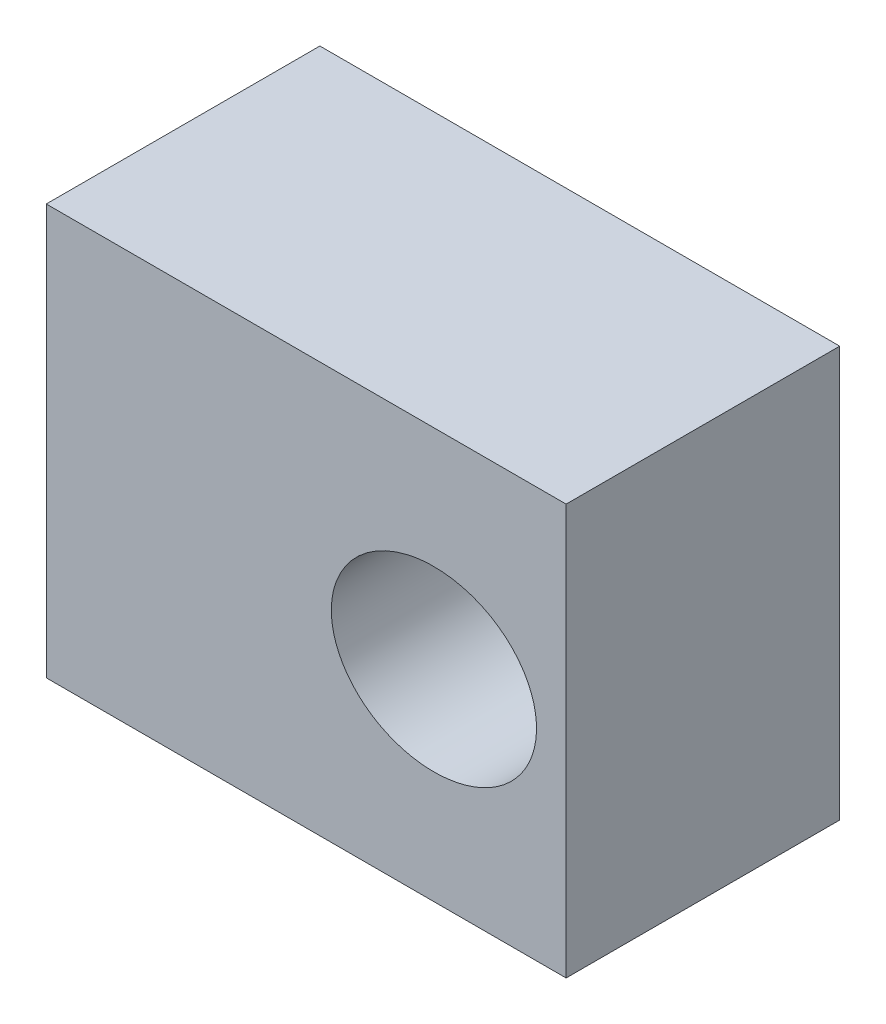
ISO-10303-21;
HEADER;
FILE_DESCRIPTION(('STEP AP214'),'2;1');
FILE_NAME('part.step','',(''),(''),'','','');
FILE_SCHEMA(('AUTOMOTIVE_DESIGN { 1 0 10303 214 1 1 1 1 }'));
ENDSEC;
DATA;
#1=APPLICATION_CONTEXT('core data for automotive mechanical design processes');
#2=APPLICATION_PROTOCOL_DEFINITION('international standard','automotive_design',2000,#1);
#3=PRODUCT_CONTEXT('',#1,'mechanical');
#4=PRODUCT('Part','Part','',(#3));
#5=PRODUCT_RELATED_PRODUCT_CATEGORY('part','',(#4));
#6=PRODUCT_DEFINITION_FORMATION('','',#4);
#7=PRODUCT_DEFINITION_CONTEXT('part definition',#1,'design');
#8=PRODUCT_DEFINITION('design','',#6,#7);
#9=PRODUCT_DEFINITION_SHAPE('','',#8);
#10=(LENGTH_UNIT() NAMED_UNIT(*) SI_UNIT(.MILLI.,.METRE.));
#11=(NAMED_UNIT(*) PLANE_ANGLE_UNIT() SI_UNIT($,.RADIAN.));
#12=(NAMED_UNIT(*) SI_UNIT($,.STERADIAN.) SOLID_ANGLE_UNIT());
#13=UNCERTAINTY_MEASURE_WITH_UNIT(LENGTH_MEASURE(1.E-05),#10,'distance_accuracy_value','');
#14=(GEOMETRIC_REPRESENTATION_CONTEXT(3) GLOBAL_UNCERTAINTY_ASSIGNED_CONTEXT((#13)) GLOBAL_UNIT_ASSIGNED_CONTEXT((#10,
#11,#12)) REPRESENTATION_CONTEXT('',''));
#15=CARTESIAN_POINT('',(0.,0.,0.));
#16=DIRECTION('',(0.,0.,1.));
#17=DIRECTION('',(1.,0.,0.));
#18=AXIS2_PLACEMENT_3D('',#15,#16,#17);
#19=CARTESIAN_POINT('',(95.,75.,0.));
#20=DIRECTION('',(0.,0.,1.));
#21=DIRECTION('',(1.,0.,0.));
#22=AXIS2_PLACEMENT_3D('',#19,#20,#21);
#23=PLANE('',#22);
#24=DIRECTION('',(0.,-1.,0.));
#25=VECTOR('',#24,1.);
#26=CARTESIAN_POINT('',(0.,150.,0.));
#27=LINE('',#26,#25);
#28=CARTESIAN_POINT('',(0.,150.,0.));
#29=VERTEX_POINT('',#28);
#30=CARTESIAN_POINT('',(0.,0.,0.));
#31=VERTEX_POINT('',#30);
#32=EDGE_CURVE('E23',#29,#31,#27,.T.);
#33=ORIENTED_EDGE('',*,*,#32,.F.);
#34=DIRECTION('',(-1.,0.,0.));
#35=VECTOR('',#34,1.);
#36=CARTESIAN_POINT('',(190.,150.,0.));
#37=LINE('',#36,#35);
#38=CARTESIAN_POINT('',(190.,150.,0.));
#39=VERTEX_POINT('',#38);
#40=EDGE_CURVE('E95',#39,#29,#37,.T.);
#41=ORIENTED_EDGE('',*,*,#40,.F.);
#42=DIRECTION('',(0.,1.,0.));
#43=VECTOR('',#42,1.);
#44=CARTESIAN_POINT('',(190.,0.,0.));
#45=LINE('',#44,#43);
#46=CARTESIAN_POINT('',(190.,0.,0.));
#47=VERTEX_POINT('',#46);
#48=EDGE_CURVE('E100',#47,#39,#45,.T.);
#49=ORIENTED_EDGE('',*,*,#48,.F.);
#50=DIRECTION('',(1.,0.,0.));
#51=VECTOR('',#50,1.);
#52=CARTESIAN_POINT('',(0.,0.,0.));
#53=LINE('',#52,#51);
#54=EDGE_CURVE('E120',#31,#47,#53,.T.);
#55=ORIENTED_EDGE('',*,*,#54,.F.);
#56=EDGE_LOOP('',(#33,#41,#49,#55));
#57=FACE_BOUND('',#56,.T.);
#58=ADVANCED_FACE('F15',(#57),#23,.F.);
#59=CARTESIAN_POINT('',(95.,75.,100.));
#60=DIRECTION('',(0.,0.,1.));
#61=DIRECTION('',(1.,0.,0.));
#62=AXIS2_PLACEMENT_3D('',#59,#60,#61);
#63=PLANE('',#62);
#64=CARTESIAN_POINT('',(141.679001894875,73.5741907440377,100.));
#65=DIRECTION('',(0.,0.,-1.));
#66=DIRECTION('',(1.,0.,0.));
#67=AXIS2_PLACEMENT_3D('',#64,#65,#66);
#68=ELLIPSE('',#67,37.5,32.5);
#69=CARTESIAN_POINT('',(104.179001894875,73.5741907440377,100.));
#70=VERTEX_POINT('',#69);
#71=EDGE_CURVE('E78',#70,#70,#68,.T.);
#72=ORIENTED_EDGE('',*,*,#71,.T.);
#73=EDGE_LOOP('',(#72));
#74=FACE_BOUND('',#73,.T.);
#75=DIRECTION('',(0.,-1.,0.));
#76=VECTOR('',#75,1.);
#77=CARTESIAN_POINT('',(0.,150.,100.));
#78=LINE('',#77,#76);
#79=CARTESIAN_POINT('',(0.,150.,100.));
#80=VERTEX_POINT('',#79);
#81=CARTESIAN_POINT('',(0.,0.,100.));
#82=VERTEX_POINT('',#81);
#83=EDGE_CURVE('E9',#80,#82,#78,.T.);
#84=ORIENTED_EDGE('',*,*,#83,.T.);
#85=DIRECTION('',(1.,0.,0.));
#86=VECTOR('',#85,1.);
#87=CARTESIAN_POINT('',(0.,0.,100.));
#88=LINE('',#87,#86);
#89=CARTESIAN_POINT('',(190.,0.,100.));
#90=VERTEX_POINT('',#89);
#91=EDGE_CURVE('E117',#82,#90,#88,.T.);
#92=ORIENTED_EDGE('',*,*,#91,.T.);
#93=DIRECTION('',(0.,1.,0.));
#94=VECTOR('',#93,1.);
#95=CARTESIAN_POINT('',(190.,0.,100.));
#96=LINE('',#95,#94);
#97=CARTESIAN_POINT('',(190.,150.,100.));
#98=VERTEX_POINT('',#97);
#99=EDGE_CURVE('E103',#90,#98,#96,.T.);
#100=ORIENTED_EDGE('',*,*,#99,.T.);
#101=DIRECTION('',(-1.,0.,0.));
#102=VECTOR('',#101,1.);
#103=CARTESIAN_POINT('',(190.,150.,100.));
#104=LINE('',#103,#102);
#105=EDGE_CURVE('E108',#98,#80,#104,.T.);
#106=ORIENTED_EDGE('',*,*,#105,.T.);
#107=EDGE_LOOP('',(#84,#92,#100,#106));
#108=FACE_BOUND('',#107,.T.);
#109=ADVANCED_FACE('F84',(#74,#108),#63,.T.);
#110=CARTESIAN_POINT('',(0.,150.,0.));
#111=DIRECTION('',(-1.,0.,0.));
#112=DIRECTION('',(0.,0.,1.));
#113=AXIS2_PLACEMENT_3D('',#110,#111,#112);
#114=PLANE('',#113);
#115=ORIENTED_EDGE('',*,*,#32,.T.);
#116=DIRECTION('',(0.,0.,1.));
#117=VECTOR('',#116,1.);
#118=CARTESIAN_POINT('',(0.,0.,0.));
#119=LINE('',#118,#117);
#120=EDGE_CURVE('E114',#31,#82,#119,.T.);
#121=ORIENTED_EDGE('',*,*,#120,.T.);
#122=ORIENTED_EDGE('',*,*,#83,.F.);
#123=DIRECTION('',(0.,0.,1.));
#124=VECTOR('',#123,1.);
#125=CARTESIAN_POINT('',(0.,150.,0.));
#126=LINE('',#125,#124);
#127=EDGE_CURVE('E99',#29,#80,#126,.T.);
#128=ORIENTED_EDGE('',*,*,#127,.F.);
#129=EDGE_LOOP('',(#115,#121,#122,#128));
#130=FACE_BOUND('',#129,.T.);
#131=ADVANCED_FACE('F187',(#130),#114,.T.);
#132=CARTESIAN_POINT('',(0.,0.,0.));
#133=DIRECTION('',(0.,-1.,0.));
#134=DIRECTION('',(0.,0.,-1.));
#135=AXIS2_PLACEMENT_3D('',#132,#133,#134);
#136=PLANE('',#135);
#137=ORIENTED_EDGE('',*,*,#54,.T.);
#138=DIRECTION('',(0.,0.,1.));
#139=VECTOR('',#138,1.);
#140=CARTESIAN_POINT('',(190.,0.,0.));
#141=LINE('',#140,#139);
#142=EDGE_CURVE('E91',#47,#90,#141,.T.);
#143=ORIENTED_EDGE('',*,*,#142,.T.);
#144=ORIENTED_EDGE('',*,*,#91,.F.);
#145=ORIENTED_EDGE('',*,*,#120,.F.);
#146=EDGE_LOOP('',(#137,#143,#144,#145));
#147=FACE_BOUND('',#146,.T.);
#148=ADVANCED_FACE('F177',(#147),#136,.T.);
#149=CARTESIAN_POINT('',(190.,0.,0.));
#150=DIRECTION('',(1.,0.,0.));
#151=DIRECTION('',(0.,1.,0.));
#152=AXIS2_PLACEMENT_3D('',#149,#150,#151);
#153=PLANE('',#152);
#154=ORIENTED_EDGE('',*,*,#48,.T.);
#155=DIRECTION('',(0.,0.,1.));
#156=VECTOR('',#155,1.);
#157=CARTESIAN_POINT('',(190.,150.,0.));
#158=LINE('',#157,#156);
#159=EDGE_CURVE('E104',#39,#98,#158,.T.);
#160=ORIENTED_EDGE('',*,*,#159,.T.);
#161=ORIENTED_EDGE('',*,*,#99,.F.);
#162=ORIENTED_EDGE('',*,*,#142,.F.);
#163=EDGE_LOOP('',(#154,#160,#161,#162));
#164=FACE_BOUND('',#163,.T.);
#165=ADVANCED_FACE('F181',(#164),#153,.T.);
#166=CARTESIAN_POINT('',(190.,150.,0.));
#167=DIRECTION('',(0.,1.,0.));
#168=DIRECTION('',(1.,0.,0.));
#169=AXIS2_PLACEMENT_3D('',#166,#167,#168);
#170=PLANE('',#169);
#171=ORIENTED_EDGE('',*,*,#40,.T.);
#172=ORIENTED_EDGE('',*,*,#127,.T.);
#173=ORIENTED_EDGE('',*,*,#105,.F.);
#174=ORIENTED_EDGE('',*,*,#159,.F.);
#175=EDGE_LOOP('',(#171,#172,#173,#174));
#176=FACE_BOUND('',#175,.T.);
#177=ADVANCED_FACE('F185',(#176),#170,.T.);
#178=CARTESIAN_POINT('',(141.679001894875,73.5741907440377,20.));
#179=DIRECTION('',(0.,0.,1.));
#180=DIRECTION('',(1.,0.,0.));
#181=AXIS2_PLACEMENT_3D('',#178,#179,#180);
#182=PLANE('',#181);
#183=CARTESIAN_POINT('',(141.679001894875,73.5741907440377,20.));
#184=DIRECTION('',(0.,0.,-1.));
#185=DIRECTION('',(1.,0.,0.));
#186=AXIS2_PLACEMENT_3D('',#183,#184,#185);
#187=ELLIPSE('',#186,37.5,32.5);
#188=CARTESIAN_POINT('',(104.179001894875,73.5741907440377,20.));
#189=VERTEX_POINT('',#188);
#190=EDGE_CURVE('E80',#189,#189,#187,.T.);
#191=ORIENTED_EDGE('',*,*,#190,.F.);
#192=EDGE_LOOP('',(#191));
#193=FACE_BOUND('',#192,.T.);
#194=ADVANCED_FACE('F205',(#193),#182,.T.);
#195=CARTESIAN_POINT('',(104.179001894875,73.5741907440377,100.));
#196=CARTESIAN_POINT('',(104.179001894875,106.074190744038,100.));
#197=CARTESIAN_POINT('',(141.679001894875,106.074190744038,100.));
#198=CARTESIAN_POINT('',(179.179001894875,106.074190744038,100.));
#199=CARTESIAN_POINT('',(179.179001894875,73.5741907440376,100.));
#200=CARTESIAN_POINT('',(179.179001894875,41.0741907440377,100.));
#201=CARTESIAN_POINT('',(141.679001894875,41.0741907440377,100.));
#202=CARTESIAN_POINT('',(104.179001894875,41.0741907440377,100.));
#203=CARTESIAN_POINT('',(104.179001894875,73.5741907440377,100.));
#204=CARTESIAN_POINT('',(104.179001894875,73.5741907440377,20.));
#205=CARTESIAN_POINT('',(104.179001894875,106.074190744038,20.));
#206=CARTESIAN_POINT('',(141.679001894875,106.074190744038,20.));
#207=CARTESIAN_POINT('',(179.179001894875,106.074190744038,20.));
#208=CARTESIAN_POINT('',(179.179001894875,73.5741907440376,20.));
#209=CARTESIAN_POINT('',(179.179001894875,41.0741907440377,20.));
#210=CARTESIAN_POINT('',(141.679001894875,41.0741907440377,20.));
#211=CARTESIAN_POINT('',(104.179001894875,41.0741907440377,20.));
#212=CARTESIAN_POINT('',(104.179001894875,73.5741907440377,20.));
#213=(BOUNDED_SURFACE() B_SPLINE_SURFACE(1,2,((#195,#196,#197,#198,#199,#200,#201,#202,#203),
(#204,#205,#206,#207,#208,#209,#210,#211,#212)),.UNSPECIFIED.,.F.,.T.,
.F.) B_SPLINE_SURFACE_WITH_KNOTS((2,2),(3,2,2,2,3),(0.,2.13333333333333),(-3.14159265358979,
-1.5707963267949,0.,1.5707963267949,3.14159265358979),
.UNSPECIFIED.) GEOMETRIC_REPRESENTATION_ITEM() RATIONAL_B_SPLINE_SURFACE(((1.,0.707106781186548,
1.,0.707106781186548,1.,0.707106781186548,1.,0.707106781186548,1.),(1.,0.707106781186548,1.,
0.707106781186548,1.,0.707106781186548,1.,0.707106781186548,1.))) REPRESENTATION_ITEM('') SURFACE());
#214=DIRECTION('',(0.,0.,-1.));
#215=VECTOR('',#214,1.);
#216=CARTESIAN_POINT('',(104.179001894875,73.5741907440377,100.));
#217=LINE('',#216,#215);
#218=EDGE_CURVE('E75',#70,#189,#217,.T.);
#219=ORIENTED_EDGE('',*,*,#71,.F.);
#220=ORIENTED_EDGE('',*,*,#218,.T.);
#221=ORIENTED_EDGE('',*,*,#190,.T.);
#222=ORIENTED_EDGE('',*,*,#218,.F.);
#223=EDGE_LOOP('',(#219,#220,#221,#222));
#224=FACE_BOUND('',#223,.T.);
#225=ADVANCED_FACE('F77',(#224),#213,.T.);
#226=CLOSED_SHELL('',(#58,#109,#131,#148,#165,#177,#194,#225));
#227=MANIFOLD_SOLID_BREP('B1',#226);
#228=ADVANCED_BREP_SHAPE_REPRESENTATION('',(#18,#227),#14);
#229=SHAPE_DEFINITION_REPRESENTATION(#9,#228);
ENDSEC;
END-ISO-10303-21;
